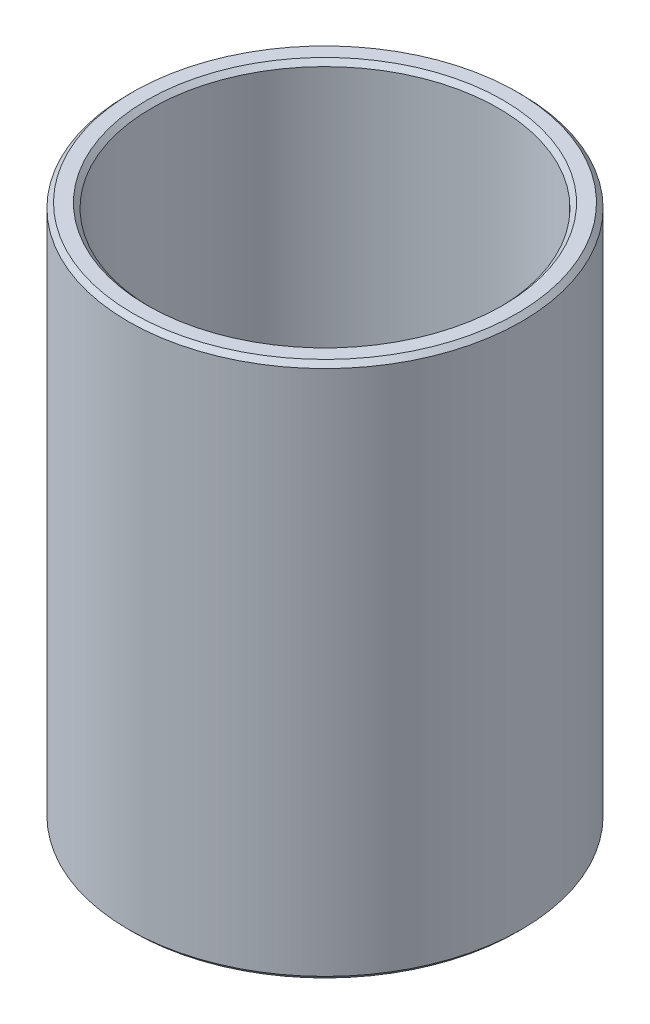
ISO-10303-21;
HEADER;
FILE_DESCRIPTION(('STEP AP214'),'2;1');
FILE_NAME('part.step','',(''),(''),'','','');
FILE_SCHEMA(('AUTOMOTIVE_DESIGN { 1 0 10303 214 1 1 1 1 }'));
ENDSEC;
DATA;
#1=APPLICATION_CONTEXT('core data for automotive mechanical design processes');
#2=APPLICATION_PROTOCOL_DEFINITION('international standard','automotive_design',2000,#1);
#3=PRODUCT_CONTEXT('',#1,'mechanical');
#4=PRODUCT('Part','Part','',(#3));
#5=PRODUCT_RELATED_PRODUCT_CATEGORY('part','',(#4));
#6=PRODUCT_DEFINITION_FORMATION('','',#4);
#7=PRODUCT_DEFINITION_CONTEXT('part definition',#1,'design');
#8=PRODUCT_DEFINITION('design','',#6,#7);
#9=PRODUCT_DEFINITION_SHAPE('','',#8);
#10=(LENGTH_UNIT() NAMED_UNIT(*) SI_UNIT(.MILLI.,.METRE.));
#11=(NAMED_UNIT(*) PLANE_ANGLE_UNIT() SI_UNIT($,.RADIAN.));
#12=(NAMED_UNIT(*) SI_UNIT($,.STERADIAN.) SOLID_ANGLE_UNIT());
#13=UNCERTAINTY_MEASURE_WITH_UNIT(LENGTH_MEASURE(1.E-05),#10,'distance_accuracy_value','');
#14=(GEOMETRIC_REPRESENTATION_CONTEXT(3) GLOBAL_UNCERTAINTY_ASSIGNED_CONTEXT((#13)) GLOBAL_UNIT_ASSIGNED_CONTEXT((#10,
#11,#12)) REPRESENTATION_CONTEXT('',''));
#15=CARTESIAN_POINT('',(0.,0.,0.));
#16=DIRECTION('',(0.,0.,1.));
#17=DIRECTION('',(1.,0.,0.));
#18=AXIS2_PLACEMENT_3D('',#15,#16,#17);
#19=CARTESIAN_POINT('',(0.,143.027386134112,0.));
#20=DIRECTION('',(0.,-1.,0.));
#21=DIRECTION('',(0.,0.,-1.));
#22=AXIS2_PLACEMENT_3D('',#19,#20,#21);
#23=CYLINDRICAL_SURFACE('',#22,52.5);
#24=CARTESIAN_POINT('',(0.,1.24218323177103,0.));
#25=DIRECTION('',(0.,1.,0.));
#26=DIRECTION('',(0.,0.,1.));
#27=AXIS2_PLACEMENT_3D('',#24,#25,#26);
#28=CIRCLE('',#27,52.5);
#29=CARTESIAN_POINT('',(0.,1.24218323177103,52.5));
#30=VERTEX_POINT('',#29);
#31=EDGE_CURVE('E10',#30,#30,#28,.T.);
#32=ORIENTED_EDGE('',*,*,#31,.T.);
#33=EDGE_LOOP('',(#32));
#34=FACE_BOUND('',#33,.T.);
#35=CARTESIAN_POINT('',(0.,141.785202902341,0.));
#36=DIRECTION('',(0.,1.,0.));
#37=DIRECTION('',(0.,0.,1.));
#38=AXIS2_PLACEMENT_3D('',#35,#36,#37);
#39=CIRCLE('',#38,52.5);
#40=CARTESIAN_POINT('',(0.,141.785202902341,52.5));
#41=VERTEX_POINT('',#40);
#42=EDGE_CURVE('E50',#41,#41,#39,.F.);
#43=ORIENTED_EDGE('',*,*,#42,.T.);
#44=EDGE_LOOP('',(#43));
#45=FACE_BOUND('',#44,.T.);
#46=ADVANCED_FACE('F39',(#34,#45),#23,.T.);
#47=CARTESIAN_POINT('',(0.,143.027386134112,0.));
#48=DIRECTION('',(0.,1.,0.));
#49=DIRECTION('',(0.,0.,1.));
#50=AXIS2_PLACEMENT_3D('',#47,#48,#49);
#51=PLANE('',#50);
#52=CARTESIAN_POINT('',(0.,143.027386134112,0.));
#53=DIRECTION('',(0.,1.,0.));
#54=DIRECTION('',(0.,0.,1.));
#55=AXIS2_PLACEMENT_3D('',#52,#53,#54);
#56=CIRCLE('',#55,47.4990907870584);
#57=CARTESIAN_POINT('',(0.,143.027386134112,47.4990907870584));
#58=VERTEX_POINT('',#57);
#59=EDGE_CURVE('E58',#58,#58,#56,.F.);
#60=ORIENTED_EDGE('',*,*,#59,.T.);
#61=EDGE_LOOP('',(#60));
#62=FACE_BOUND('',#61,.T.);
#63=CARTESIAN_POINT('',(0.,143.027386134112,0.));
#64=DIRECTION('',(0.,1.,0.));
#65=DIRECTION('',(0.,0.,1.));
#66=AXIS2_PLACEMENT_3D('',#63,#64,#65);
#67=CIRCLE('',#66,51.257816768229);
#68=CARTESIAN_POINT('',(0.,143.027386134112,51.257816768229));
#69=VERTEX_POINT('',#68);
#70=EDGE_CURVE('E61',#69,#69,#67,.T.);
#71=ORIENTED_EDGE('',*,*,#70,.T.);
#72=EDGE_LOOP('',(#71));
#73=FACE_BOUND('',#72,.T.);
#74=ADVANCED_FACE('F88',(#62,#73),#51,.T.);
#75=CARTESIAN_POINT('',(0.,0.,0.));
#76=DIRECTION('',(0.,1.,0.));
#77=DIRECTION('',(0.,0.,1.));
#78=AXIS2_PLACEMENT_3D('',#75,#76,#77);
#79=PLANE('',#78);
#80=CARTESIAN_POINT('',(0.,0.,0.));
#81=DIRECTION('',(0.,1.,0.));
#82=DIRECTION('',(0.,0.,1.));
#83=AXIS2_PLACEMENT_3D('',#80,#81,#82);
#84=CIRCLE('',#83,47.4990907870584);
#85=CARTESIAN_POINT('',(0.,0.,47.4990907870584));
#86=VERTEX_POINT('',#85);
#87=EDGE_CURVE('E51',#86,#86,#84,.T.);
#88=ORIENTED_EDGE('',*,*,#87,.T.);
#89=EDGE_LOOP('',(#88));
#90=FACE_BOUND('',#89,.T.);
#91=CARTESIAN_POINT('',(0.,0.,0.));
#92=DIRECTION('',(0.,1.,0.));
#93=DIRECTION('',(0.,0.,1.));
#94=AXIS2_PLACEMENT_3D('',#91,#92,#93);
#95=CIRCLE('',#94,51.257816768229);
#96=CARTESIAN_POINT('',(0.,0.,51.257816768229));
#97=VERTEX_POINT('',#96);
#98=EDGE_CURVE('E54',#97,#97,#95,.F.);
#99=ORIENTED_EDGE('',*,*,#98,.T.);
#100=EDGE_LOOP('',(#99));
#101=FACE_BOUND('',#100,.T.);
#102=ADVANCED_FACE('F83',(#90,#101),#79,.F.);
#103=CARTESIAN_POINT('',(0.,143.027386134112,0.));
#104=DIRECTION('',(0.,-1.,0.));
#105=DIRECTION('',(0.,0.,-1.));
#106=AXIS2_PLACEMENT_3D('',#103,#104,#105);
#107=CYLINDRICAL_SURFACE('',#106,46.2569075552874);
#108=CARTESIAN_POINT('',(0.,141.785202902341,0.));
#109=DIRECTION('',(0.,1.,0.));
#110=DIRECTION('',(0.,0.,1.));
#111=AXIS2_PLACEMENT_3D('',#108,#109,#110);
#112=CIRCLE('',#111,46.2569075552874);
#113=CARTESIAN_POINT('',(0.,141.785202902341,46.2569075552874));
#114=VERTEX_POINT('',#113);
#115=EDGE_CURVE('E67',#114,#114,#112,.T.);
#116=ORIENTED_EDGE('',*,*,#115,.T.);
#117=EDGE_LOOP('',(#116));
#118=FACE_BOUND('',#117,.T.);
#119=CARTESIAN_POINT('',(0.,1.24218323177105,0.));
#120=DIRECTION('',(0.,1.,0.));
#121=DIRECTION('',(0.,0.,1.));
#122=AXIS2_PLACEMENT_3D('',#119,#120,#121);
#123=CIRCLE('',#122,46.2569075552874);
#124=CARTESIAN_POINT('',(0.,1.24218323177105,46.2569075552874));
#125=VERTEX_POINT('',#124);
#126=EDGE_CURVE('E69',#125,#125,#123,.F.);
#127=ORIENTED_EDGE('',*,*,#126,.T.);
#128=EDGE_LOOP('',(#127));
#129=FACE_BOUND('',#128,.T.);
#130=ADVANCED_FACE('F71',(#118,#129),#107,.F.);
#131=CARTESIAN_POINT('',(0.,141.785202902341,0.));
#132=DIRECTION('',(0.,1.,0.));
#133=DIRECTION('',(0.,0.,1.));
#134=AXIS2_PLACEMENT_3D('',#131,#132,#133);
#135=CONICAL_SURFACE('',#134,46.2569075552874,0.785398163397443);
#136=ORIENTED_EDGE('',*,*,#59,.F.);
#137=EDGE_LOOP('',(#136));
#138=FACE_BOUND('',#137,.T.);
#139=ORIENTED_EDGE('',*,*,#115,.F.);
#140=EDGE_LOOP('',(#139));
#141=FACE_BOUND('',#140,.T.);
#142=ADVANCED_FACE('F77',(#138,#141),#135,.F.);
#143=CARTESIAN_POINT('',(0.,0.,0.));
#144=DIRECTION('',(0.,-1.,0.));
#145=DIRECTION('',(0.,0.,-1.));
#146=AXIS2_PLACEMENT_3D('',#143,#144,#145);
#147=CONICAL_SURFACE('',#146,47.4990907870584,0.785398163397446);
#148=ORIENTED_EDGE('',*,*,#126,.F.);
#149=EDGE_LOOP('',(#148));
#150=FACE_BOUND('',#149,.T.);
#151=ORIENTED_EDGE('',*,*,#87,.F.);
#152=EDGE_LOOP('',(#151));
#153=FACE_BOUND('',#152,.T.);
#154=ADVANCED_FACE('F73',(#150,#153),#147,.F.);
#155=CARTESIAN_POINT('',(0.,1.24218323177103,0.));
#156=DIRECTION('',(0.,1.,0.));
#157=DIRECTION('',(0.,0.,1.));
#158=AXIS2_PLACEMENT_3D('',#155,#156,#157);
#159=CONICAL_SURFACE('',#158,52.5,0.78539816339744);
#160=ORIENTED_EDGE('',*,*,#98,.F.);
#161=EDGE_LOOP('',(#160));
#162=FACE_BOUND('',#161,.T.);
#163=ORIENTED_EDGE('',*,*,#31,.F.);
#164=EDGE_LOOP('',(#163));
#165=FACE_BOUND('',#164,.T.);
#166=ADVANCED_FACE('F76',(#162,#165),#159,.T.);
#167=CARTESIAN_POINT('',(0.,143.027386134112,0.));
#168=DIRECTION('',(0.,-1.,0.));
#169=DIRECTION('',(0.,0.,-1.));
#170=AXIS2_PLACEMENT_3D('',#167,#168,#169);
#171=CONICAL_SURFACE('',#170,51.257816768229,0.785398163397443);
#172=ORIENTED_EDGE('',*,*,#42,.F.);
#173=EDGE_LOOP('',(#172));
#174=FACE_BOUND('',#173,.T.);
#175=ORIENTED_EDGE('',*,*,#70,.F.);
#176=EDGE_LOOP('',(#175));
#177=FACE_BOUND('',#176,.T.);
#178=ADVANCED_FACE('F45',(#174,#177),#171,.T.);
#179=CLOSED_SHELL('',(#46,#74,#102,#130,#142,#154,#166,#178));
#180=MANIFOLD_SOLID_BREP('B2',#179);
#181=ADVANCED_BREP_SHAPE_REPRESENTATION('',(#18,#180),#14);
#182=SHAPE_DEFINITION_REPRESENTATION(#9,#181);
ENDSEC;
END-ISO-10303-21;
